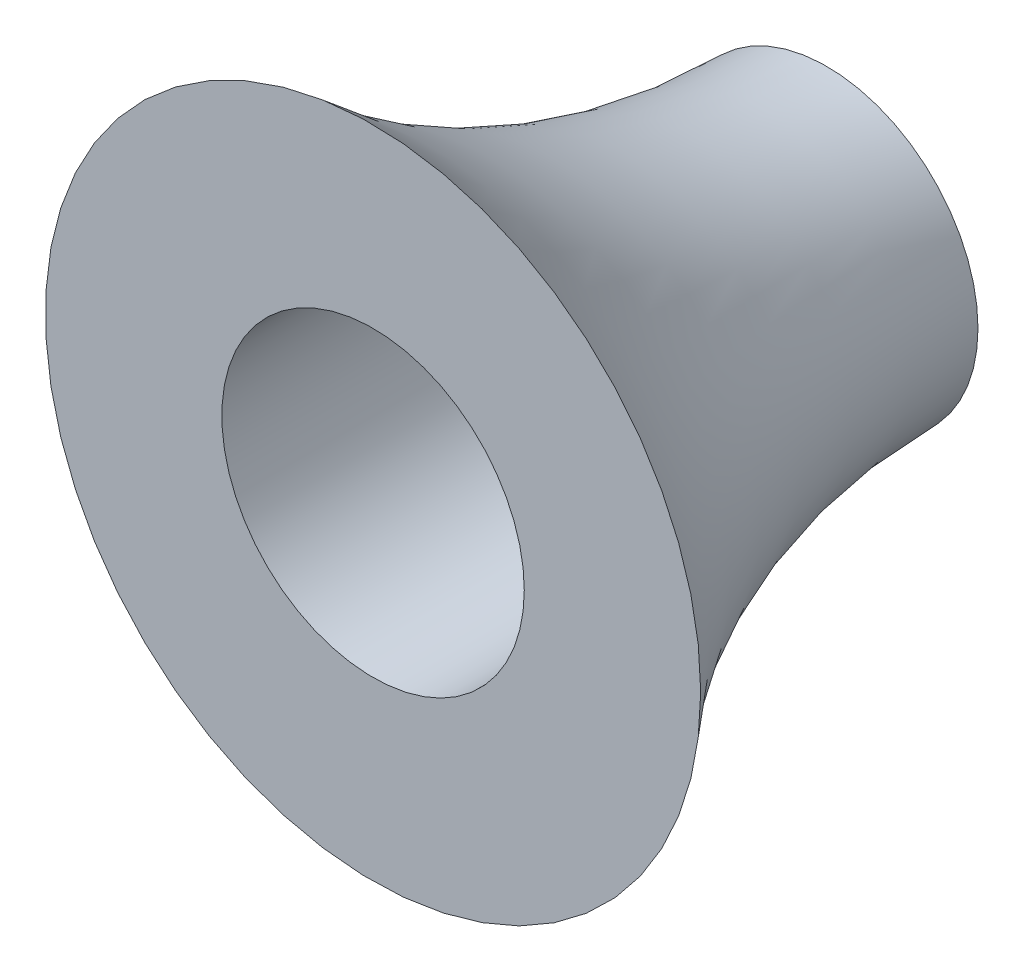
ISO-10303-21;
HEADER;
FILE_DESCRIPTION(('STEP AP214'),'2;1');
FILE_NAME('part.step','',(''),(''),'','','');
FILE_SCHEMA(('AUTOMOTIVE_DESIGN { 1 0 10303 214 1 1 1 1 }'));
ENDSEC;
DATA;
#1=APPLICATION_CONTEXT('core data for automotive mechanical design processes');
#2=APPLICATION_PROTOCOL_DEFINITION('international standard','automotive_design',2000,#1);
#3=PRODUCT_CONTEXT('',#1,'mechanical');
#4=PRODUCT('Part','Part','',(#3));
#5=PRODUCT_RELATED_PRODUCT_CATEGORY('part','',(#4));
#6=PRODUCT_DEFINITION_FORMATION('','',#4);
#7=PRODUCT_DEFINITION_CONTEXT('part definition',#1,'design');
#8=PRODUCT_DEFINITION('design','',#6,#7);
#9=PRODUCT_DEFINITION_SHAPE('','',#8);
#10=(LENGTH_UNIT() NAMED_UNIT(*) SI_UNIT(.MILLI.,.METRE.));
#11=(NAMED_UNIT(*) PLANE_ANGLE_UNIT() SI_UNIT($,.RADIAN.));
#12=(NAMED_UNIT(*) SI_UNIT($,.STERADIAN.) SOLID_ANGLE_UNIT());
#13=UNCERTAINTY_MEASURE_WITH_UNIT(LENGTH_MEASURE(1.E-05),#10,'distance_accuracy_value','');
#14=(GEOMETRIC_REPRESENTATION_CONTEXT(3) GLOBAL_UNCERTAINTY_ASSIGNED_CONTEXT((#13)) GLOBAL_UNIT_ASSIGNED_CONTEXT((#10,
#11,#12)) REPRESENTATION_CONTEXT('',''));
#15=CARTESIAN_POINT('',(0.,0.,0.));
#16=DIRECTION('',(0.,0.,1.));
#17=DIRECTION('',(1.,0.,0.));
#18=AXIS2_PLACEMENT_3D('',#15,#16,#17);
#19=CARTESIAN_POINT('',(-4.55805526532028,3.31694473467972,-7.02));
#20=DIRECTION('',(0.,0.,1.));
#21=DIRECTION('',(1.,0.,0.));
#22=AXIS2_PLACEMENT_3D('',#19,#20,#21);
#23=PLANE('',#22);
#24=CARTESIAN_POINT('',(-3.675,4.2,-7.02));
#25=DIRECTION('',(0.,0.,1.));
#26=DIRECTION('',(1.,0.,0.));
#27=AXIS2_PLACEMENT_3D('',#24,#25,#26);
#28=CIRCLE('',#27,0.299999999999999);
#29=CARTESIAN_POINT('',(-3.375,4.2,-7.02));
#30=VERTEX_POINT('',#29);
#31=EDGE_CURVE('E19',#30,#30,#28,.T.);
#32=ORIENTED_EDGE('',*,*,#31,.F.);
#33=EDGE_LOOP('',(#32));
#34=FACE_BOUND('',#33,.T.);
#35=CARTESIAN_POINT('',(-3.675,4.2,-7.01999999999981));
#36=DIRECTION('',(0.,0.,1.));
#37=DIRECTION('',(1.,0.,0.));
#38=AXIS2_PLACEMENT_3D('',#35,#36,#37);
#39=CIRCLE('',#38,0.650000000001199);
#40=CARTESIAN_POINT('',(-3.0249999999988,4.2,-7.01999999999981));
#41=VERTEX_POINT('',#40);
#42=EDGE_CURVE('E23',#41,#41,#39,.F.);
#43=ORIENTED_EDGE('',*,*,#42,.F.);
#44=EDGE_LOOP('',(#43));
#45=FACE_BOUND('',#44,.T.);
#46=ADVANCED_FACE('F15',(#34,#45),#23,.T.);
#47=CARTESIAN_POINT('',(-3.675,4.2,-7.92));
#48=DIRECTION('',(0.,0.,1.));
#49=DIRECTION('',(1.,0.,0.));
#50=AXIS2_PLACEMENT_3D('',#47,#48,#49);
#51=CYLINDRICAL_SURFACE('',#50,0.299999999999999);
#52=ORIENTED_EDGE('',*,*,#31,.T.);
#53=EDGE_LOOP('',(#52));
#54=FACE_BOUND('',#53,.T.);
#55=CARTESIAN_POINT('',(-3.675,4.2,-7.92));
#56=DIRECTION('',(0.,0.,1.));
#57=DIRECTION('',(1.,0.,0.));
#58=AXIS2_PLACEMENT_3D('',#55,#56,#57);
#59=CIRCLE('',#58,0.299999999999999);
#60=CARTESIAN_POINT('',(-3.375,4.2,-7.92));
#61=VERTEX_POINT('',#60);
#62=EDGE_CURVE('E10',#61,#61,#59,.T.);
#63=ORIENTED_EDGE('',*,*,#62,.F.);
#64=EDGE_LOOP('',(#63));
#65=FACE_BOUND('',#64,.T.);
#66=ADVANCED_FACE('F33',(#54,#65),#51,.F.);
#67=CARTESIAN_POINT('',(-3.675,4.2,-7.92));
#68=DIRECTION('',(0.,0.,1.));
#69=DIRECTION('',(1.,0.,0.));
#70=AXIS2_PLACEMENT_3D('',#67,#68,#69);
#71=TOROIDAL_SURFACE('',#70,1.63214285713998,1.33214285713999);
#72=ORIENTED_EDGE('',*,*,#62,.T.);
#73=EDGE_LOOP('',(#72));
#74=FACE_BOUND('',#73,.T.);
#75=ORIENTED_EDGE('',*,*,#42,.T.);
#76=EDGE_LOOP('',(#75));
#77=FACE_BOUND('',#76,.T.);
#78=ADVANCED_FACE('F17',(#74,#77),#71,.F.);
#79=CLOSED_SHELL('',(#46,#66,#78));
#80=MANIFOLD_SOLID_BREP('B1',#79);
#81=ADVANCED_BREP_SHAPE_REPRESENTATION('',(#18,#80),#14);
#82=SHAPE_DEFINITION_REPRESENTATION(#9,#81);
ENDSEC;
END-ISO-10303-21;
